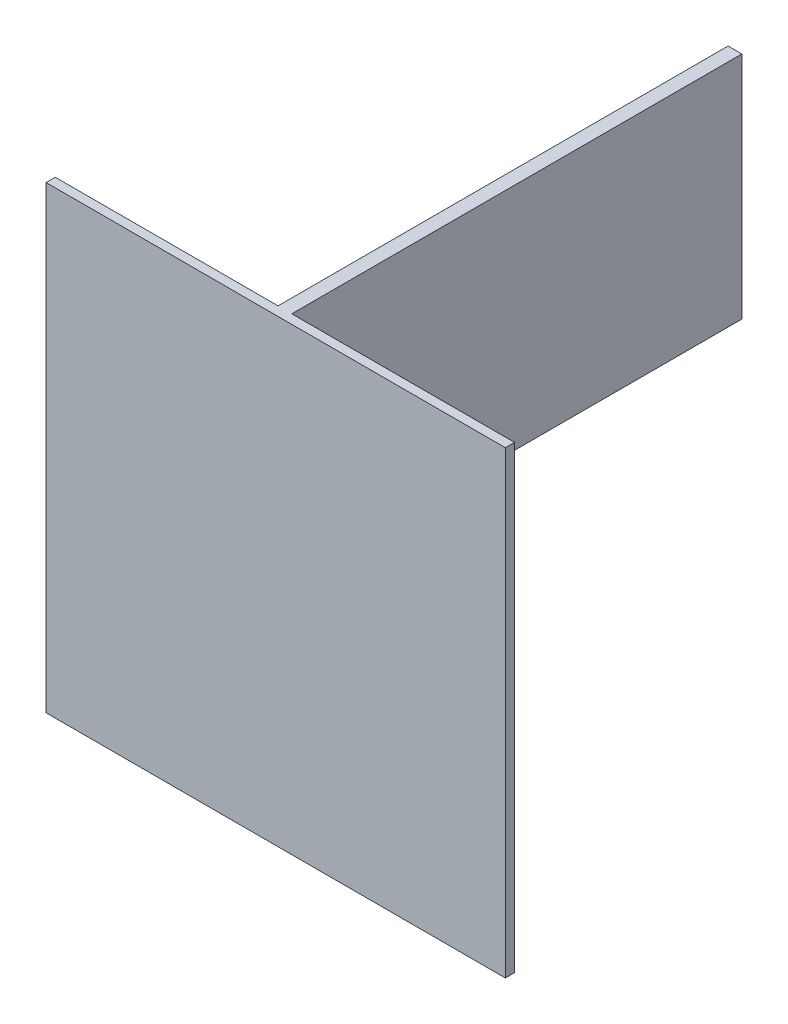
ISO-10303-21;
HEADER;
FILE_DESCRIPTION(('STEP AP214'),'2;1');
FILE_NAME('part.step','',(''),(''),'','','');
FILE_SCHEMA(('AUTOMOTIVE_DESIGN { 1 0 10303 214 1 1 1 1 }'));
ENDSEC;
DATA;
#1=APPLICATION_CONTEXT('core data for automotive mechanical design processes');
#2=APPLICATION_PROTOCOL_DEFINITION('international standard','automotive_design',2000,#1);
#3=PRODUCT_CONTEXT('',#1,'mechanical');
#4=PRODUCT('Part','Part','',(#3));
#5=PRODUCT_RELATED_PRODUCT_CATEGORY('part','',(#4));
#6=PRODUCT_DEFINITION_FORMATION('','',#4);
#7=PRODUCT_DEFINITION_CONTEXT('part definition',#1,'design');
#8=PRODUCT_DEFINITION('design','',#6,#7);
#9=PRODUCT_DEFINITION_SHAPE('','',#8);
#10=(LENGTH_UNIT() NAMED_UNIT(*) SI_UNIT(.MILLI.,.METRE.));
#11=(NAMED_UNIT(*) PLANE_ANGLE_UNIT() SI_UNIT($,.RADIAN.));
#12=(NAMED_UNIT(*) SI_UNIT($,.STERADIAN.) SOLID_ANGLE_UNIT());
#13=UNCERTAINTY_MEASURE_WITH_UNIT(LENGTH_MEASURE(1.E-05),#10,'distance_accuracy_value','');
#14=(GEOMETRIC_REPRESENTATION_CONTEXT(3) GLOBAL_UNCERTAINTY_ASSIGNED_CONTEXT((#13)) GLOBAL_UNIT_ASSIGNED_CONTEXT((#10,
#11,#12)) REPRESENTATION_CONTEXT('',''));
#15=CARTESIAN_POINT('',(0.,0.,0.));
#16=DIRECTION('',(0.,0.,1.));
#17=DIRECTION('',(1.,0.,0.));
#18=AXIS2_PLACEMENT_3D('',#15,#16,#17);
#19=CARTESIAN_POINT('',(0.,0.,0.));
#20=DIRECTION('',(0.,0.,1.));
#21=DIRECTION('',(1.,0.,0.));
#22=AXIS2_PLACEMENT_3D('',#19,#20,#21);
#23=PLANE('',#22);
#24=DIRECTION('',(0.,1.,0.));
#25=VECTOR('',#24,1.);
#26=CARTESIAN_POINT('',(-3.,0.,0.));
#27=LINE('',#26,#25);
#28=CARTESIAN_POINT('',(-3.,0.,0.));
#29=VERTEX_POINT('',#28);
#30=CARTESIAN_POINT('',(-3.,100.,0.));
#31=VERTEX_POINT('',#30);
#32=EDGE_CURVE('E192',#29,#31,#27,.T.);
#33=ORIENTED_EDGE('',*,*,#32,.F.);
#34=DIRECTION('',(1.,0.,0.));
#35=VECTOR('',#34,1.);
#36=CARTESIAN_POINT('',(0.,0.,0.));
#37=LINE('',#36,#35);
#38=CARTESIAN_POINT('',(3.,0.,0.));
#39=VERTEX_POINT('',#38);
#40=EDGE_CURVE('E132',#29,#39,#37,.T.);
#41=ORIENTED_EDGE('',*,*,#40,.T.);
#42=DIRECTION('',(0.,1.,0.));
#43=VECTOR('',#42,1.);
#44=CARTESIAN_POINT('',(3.,0.,0.));
#45=LINE('',#44,#43);
#46=CARTESIAN_POINT('',(3.,100.,0.));
#47=VERTEX_POINT('',#46);
#48=EDGE_CURVE('E185',#39,#47,#45,.T.);
#49=ORIENTED_EDGE('',*,*,#48,.T.);
#50=DIRECTION('',(-1.,0.,0.));
#51=VECTOR('',#50,1.);
#52=CARTESIAN_POINT('',(0.,100.,0.));
#53=LINE('',#52,#51);
#54=CARTESIAN_POINT('',(100.,100.,0.));
#55=VERTEX_POINT('',#54);
#56=EDGE_CURVE('E164',#55,#47,#53,.T.);
#57=ORIENTED_EDGE('',*,*,#56,.F.);
#58=DIRECTION('',(0.,-1.,0.));
#59=VECTOR('',#58,1.);
#60=CARTESIAN_POINT('',(100.,0.,0.));
#61=LINE('',#60,#59);
#62=CARTESIAN_POINT('',(100.,-100.,0.));
#63=VERTEX_POINT('',#62);
#64=EDGE_CURVE('E142',#55,#63,#61,.T.);
#65=ORIENTED_EDGE('',*,*,#64,.T.);
#66=DIRECTION('',(-1.,0.,0.));
#67=VECTOR('',#66,1.);
#68=CARTESIAN_POINT('',(0.,-100.,0.));
#69=LINE('',#68,#67);
#70=CARTESIAN_POINT('',(-100.,-100.,0.));
#71=VERTEX_POINT('',#70);
#72=EDGE_CURVE('E137',#63,#71,#69,.T.);
#73=ORIENTED_EDGE('',*,*,#72,.T.);
#74=DIRECTION('',(0.,-1.,0.));
#75=VECTOR('',#74,1.);
#76=CARTESIAN_POINT('',(-100.,0.,0.));
#77=LINE('',#76,#75);
#78=CARTESIAN_POINT('',(-100.,100.,0.));
#79=VERTEX_POINT('',#78);
#80=EDGE_CURVE('E151',#79,#71,#77,.T.);
#81=ORIENTED_EDGE('',*,*,#80,.F.);
#82=EDGE_CURVE('E163',#31,#79,#53,.T.);
#83=ORIENTED_EDGE('',*,*,#82,.F.);
#84=EDGE_LOOP('',(#33,#41,#49,#57,#65,#73,#81,#83));
#85=FACE_BOUND('',#84,.T.);
#86=ADVANCED_FACE('F39',(#85),#23,.F.);
#87=CARTESIAN_POINT('',(0.,-100.,4.));
#88=DIRECTION('',(0.,-1.,0.));
#89=DIRECTION('',(0.,0.,-1.));
#90=AXIS2_PLACEMENT_3D('',#87,#88,#89);
#91=PLANE('',#90);
#92=ORIENTED_EDGE('',*,*,#72,.F.);
#93=DIRECTION('',(0.,0.,-1.));
#94=VECTOR('',#93,1.);
#95=CARTESIAN_POINT('',(100.,-100.,4.));
#96=LINE('',#95,#94);
#97=CARTESIAN_POINT('',(100.,-100.,4.));
#98=VERTEX_POINT('',#97);
#99=EDGE_CURVE('E11',#98,#63,#96,.T.);
#100=ORIENTED_EDGE('',*,*,#99,.F.);
#101=DIRECTION('',(-1.,0.,0.));
#102=VECTOR('',#101,1.);
#103=CARTESIAN_POINT('',(0.,-100.,4.));
#104=LINE('',#103,#102);
#105=CARTESIAN_POINT('',(-100.,-100.,4.));
#106=VERTEX_POINT('',#105);
#107=EDGE_CURVE('E147',#98,#106,#104,.T.);
#108=ORIENTED_EDGE('',*,*,#107,.T.);
#109=DIRECTION('',(0.,0.,-1.));
#110=VECTOR('',#109,1.);
#111=CARTESIAN_POINT('',(-100.,-100.,4.));
#112=LINE('',#111,#110);
#113=EDGE_CURVE('E84',#106,#71,#112,.T.);
#114=ORIENTED_EDGE('',*,*,#113,.T.);
#115=EDGE_LOOP('',(#92,#100,#108,#114));
#116=FACE_BOUND('',#115,.T.);
#117=ADVANCED_FACE('F41',(#116),#91,.T.);
#118=CARTESIAN_POINT('',(100.,0.,4.));
#119=DIRECTION('',(1.,0.,0.));
#120=DIRECTION('',(0.,0.,-1.));
#121=AXIS2_PLACEMENT_3D('',#118,#119,#120);
#122=PLANE('',#121);
#123=ORIENTED_EDGE('',*,*,#64,.F.);
#124=DIRECTION('',(0.,0.,-1.));
#125=VECTOR('',#124,1.);
#126=CARTESIAN_POINT('',(100.,100.,4.));
#127=LINE('',#126,#125);
#128=CARTESIAN_POINT('',(100.,100.,4.));
#129=VERTEX_POINT('',#128);
#130=EDGE_CURVE('E48',#129,#55,#127,.T.);
#131=ORIENTED_EDGE('',*,*,#130,.F.);
#132=DIRECTION('',(0.,-1.,0.));
#133=VECTOR('',#132,1.);
#134=CARTESIAN_POINT('',(100.,0.,4.));
#135=LINE('',#134,#133);
#136=EDGE_CURVE('E150',#129,#98,#135,.T.);
#137=ORIENTED_EDGE('',*,*,#136,.T.);
#138=ORIENTED_EDGE('',*,*,#99,.T.);
#139=EDGE_LOOP('',(#123,#131,#137,#138));
#140=FACE_BOUND('',#139,.T.);
#141=ADVANCED_FACE('F186',(#140),#122,.T.);
#142=CARTESIAN_POINT('',(0.,100.,4.));
#143=DIRECTION('',(0.,-1.,0.));
#144=DIRECTION('',(0.,0.,-1.));
#145=AXIS2_PLACEMENT_3D('',#142,#143,#144);
#146=PLANE('',#145);
#147=ORIENTED_EDGE('',*,*,#56,.T.);
#148=DIRECTION('',(0.,0.,1.));
#149=VECTOR('',#148,1.);
#150=CARTESIAN_POINT('',(3.,100.,-196.));
#151=LINE('',#150,#149);
#152=CARTESIAN_POINT('',(3.,100.,-196.));
#153=VERTEX_POINT('',#152);
#154=EDGE_CURVE('E55',#153,#47,#151,.T.);
#155=ORIENTED_EDGE('',*,*,#154,.F.);
#156=DIRECTION('',(-1.,0.,0.));
#157=VECTOR('',#156,1.);
#158=CARTESIAN_POINT('',(3.,100.,-196.));
#159=LINE('',#158,#157);
#160=CARTESIAN_POINT('',(-3.,100.,-196.));
#161=VERTEX_POINT('',#160);
#162=EDGE_CURVE('E123',#153,#161,#159,.T.);
#163=ORIENTED_EDGE('',*,*,#162,.T.);
#164=DIRECTION('',(0.,0.,1.));
#165=VECTOR('',#164,1.);
#166=CARTESIAN_POINT('',(-3.,100.,-196.));
#167=LINE('',#166,#165);
#168=EDGE_CURVE('E118',#161,#31,#167,.T.);
#169=ORIENTED_EDGE('',*,*,#168,.T.);
#170=ORIENTED_EDGE('',*,*,#82,.T.);
#171=DIRECTION('',(0.,0.,-1.));
#172=VECTOR('',#171,1.);
#173=CARTESIAN_POINT('',(-100.,100.,4.));
#174=LINE('',#173,#172);
#175=CARTESIAN_POINT('',(-100.,100.,4.));
#176=VERTEX_POINT('',#175);
#177=EDGE_CURVE('E172',#176,#79,#174,.T.);
#178=ORIENTED_EDGE('',*,*,#177,.F.);
#179=DIRECTION('',(-1.,0.,0.));
#180=VECTOR('',#179,1.);
#181=CARTESIAN_POINT('',(0.,100.,4.));
#182=LINE('',#181,#180);
#183=EDGE_CURVE('E155',#129,#176,#182,.T.);
#184=ORIENTED_EDGE('',*,*,#183,.F.);
#185=ORIENTED_EDGE('',*,*,#130,.T.);
#186=EDGE_LOOP('',(#147,#155,#163,#169,#170,#178,#184,#185));
#187=FACE_BOUND('',#186,.T.);
#188=ADVANCED_FACE('F179',(#187),#146,.F.);
#189=CARTESIAN_POINT('',(-100.,0.,4.));
#190=DIRECTION('',(1.,0.,0.));
#191=DIRECTION('',(0.,0.,-1.));
#192=AXIS2_PLACEMENT_3D('',#189,#190,#191);
#193=PLANE('',#192);
#194=ORIENTED_EDGE('',*,*,#80,.T.);
#195=ORIENTED_EDGE('',*,*,#113,.F.);
#196=DIRECTION('',(0.,-1.,0.));
#197=VECTOR('',#196,1.);
#198=CARTESIAN_POINT('',(-100.,0.,4.));
#199=LINE('',#198,#197);
#200=EDGE_CURVE('E64',#176,#106,#199,.T.);
#201=ORIENTED_EDGE('',*,*,#200,.F.);
#202=ORIENTED_EDGE('',*,*,#177,.T.);
#203=EDGE_LOOP('',(#194,#195,#201,#202));
#204=FACE_BOUND('',#203,.T.);
#205=ADVANCED_FACE('F190',(#204),#193,.F.);
#206=CARTESIAN_POINT('',(0.,0.,4.));
#207=DIRECTION('',(0.,0.,1.));
#208=DIRECTION('',(1.,0.,0.));
#209=AXIS2_PLACEMENT_3D('',#206,#207,#208);
#210=PLANE('',#209);
#211=ORIENTED_EDGE('',*,*,#107,.F.);
#212=ORIENTED_EDGE('',*,*,#136,.F.);
#213=ORIENTED_EDGE('',*,*,#183,.T.);
#214=ORIENTED_EDGE('',*,*,#200,.T.);
#215=EDGE_LOOP('',(#211,#212,#213,#214));
#216=FACE_BOUND('',#215,.T.);
#217=ADVANCED_FACE('F215',(#216),#210,.T.);
#218=CARTESIAN_POINT('',(-3.,0.,-196.));
#219=DIRECTION('',(1.,0.,0.));
#220=DIRECTION('',(0.,1.,0.));
#221=AXIS2_PLACEMENT_3D('',#218,#219,#220);
#222=PLANE('',#221);
#223=ORIENTED_EDGE('',*,*,#32,.T.);
#224=ORIENTED_EDGE('',*,*,#168,.F.);
#225=DIRECTION('',(0.,1.,0.));
#226=VECTOR('',#225,1.);
#227=CARTESIAN_POINT('',(-3.,0.,-196.));
#228=LINE('',#227,#226);
#229=CARTESIAN_POINT('',(-3.,0.,-196.));
#230=VERTEX_POINT('',#229);
#231=EDGE_CURVE('E111',#230,#161,#228,.T.);
#232=ORIENTED_EDGE('',*,*,#231,.F.);
#233=DIRECTION('',(0.,0.,1.));
#234=VECTOR('',#233,1.);
#235=CARTESIAN_POINT('',(-3.,0.,-196.));
#236=LINE('',#235,#234);
#237=EDGE_CURVE('E116',#230,#29,#236,.T.);
#238=ORIENTED_EDGE('',*,*,#237,.T.);
#239=EDGE_LOOP('',(#223,#224,#232,#238));
#240=FACE_BOUND('',#239,.T.);
#241=ADVANCED_FACE('F114',(#240),#222,.F.);
#242=CARTESIAN_POINT('',(3.,0.,-196.));
#243=DIRECTION('',(1.,0.,0.));
#244=DIRECTION('',(0.,1.,0.));
#245=AXIS2_PLACEMENT_3D('',#242,#243,#244);
#246=PLANE('',#245);
#247=ORIENTED_EDGE('',*,*,#48,.F.);
#248=DIRECTION('',(0.,0.,1.));
#249=VECTOR('',#248,1.);
#250=CARTESIAN_POINT('',(3.,0.,-196.));
#251=LINE('',#250,#249);
#252=CARTESIAN_POINT('',(3.,0.,-196.));
#253=VERTEX_POINT('',#252);
#254=EDGE_CURVE('E202',#253,#39,#251,.T.);
#255=ORIENTED_EDGE('',*,*,#254,.F.);
#256=DIRECTION('',(0.,1.,0.));
#257=VECTOR('',#256,1.);
#258=CARTESIAN_POINT('',(3.,0.,-196.));
#259=LINE('',#258,#257);
#260=EDGE_CURVE('E128',#253,#153,#259,.T.);
#261=ORIENTED_EDGE('',*,*,#260,.T.);
#262=ORIENTED_EDGE('',*,*,#154,.T.);
#263=EDGE_LOOP('',(#247,#255,#261,#262));
#264=FACE_BOUND('',#263,.T.);
#265=ADVANCED_FACE('F207',(#264),#246,.T.);
#266=CARTESIAN_POINT('',(0.,0.,-196.));
#267=DIRECTION('',(0.,-1.,0.));
#268=DIRECTION('',(1.,0.,0.));
#269=AXIS2_PLACEMENT_3D('',#266,#267,#268);
#270=PLANE('',#269);
#271=ORIENTED_EDGE('',*,*,#40,.F.);
#272=ORIENTED_EDGE('',*,*,#237,.F.);
#273=DIRECTION('',(-1.,0.,0.));
#274=VECTOR('',#273,1.);
#275=CARTESIAN_POINT('',(0.,0.,-196.));
#276=LINE('',#275,#274);
#277=EDGE_CURVE('E124',#253,#230,#276,.T.);
#278=ORIENTED_EDGE('',*,*,#277,.F.);
#279=ORIENTED_EDGE('',*,*,#254,.T.);
#280=EDGE_LOOP('',(#271,#272,#278,#279));
#281=FACE_BOUND('',#280,.T.);
#282=ADVANCED_FACE('F134',(#281),#270,.T.);
#283=CARTESIAN_POINT('',(0.,0.,-196.));
#284=DIRECTION('',(0.,0.,-1.));
#285=DIRECTION('',(-1.,0.,0.));
#286=AXIS2_PLACEMENT_3D('',#283,#284,#285);
#287=PLANE('',#286);
#288=ORIENTED_EDGE('',*,*,#277,.T.);
#289=ORIENTED_EDGE('',*,*,#231,.T.);
#290=ORIENTED_EDGE('',*,*,#162,.F.);
#291=ORIENTED_EDGE('',*,*,#260,.F.);
#292=EDGE_LOOP('',(#288,#289,#290,#291));
#293=FACE_BOUND('',#292,.T.);
#294=ADVANCED_FACE('F127',(#293),#287,.T.);
#295=CLOSED_SHELL('',(#86,#117,#141,#188,#205,#217,#241,#265,#282,#294));
#296=MANIFOLD_SOLID_BREP('B2',#295);
#297=ADVANCED_BREP_SHAPE_REPRESENTATION('',(#18,#296),#14);
#298=SHAPE_DEFINITION_REPRESENTATION(#9,#297);
ENDSEC;
END-ISO-10303-21;
